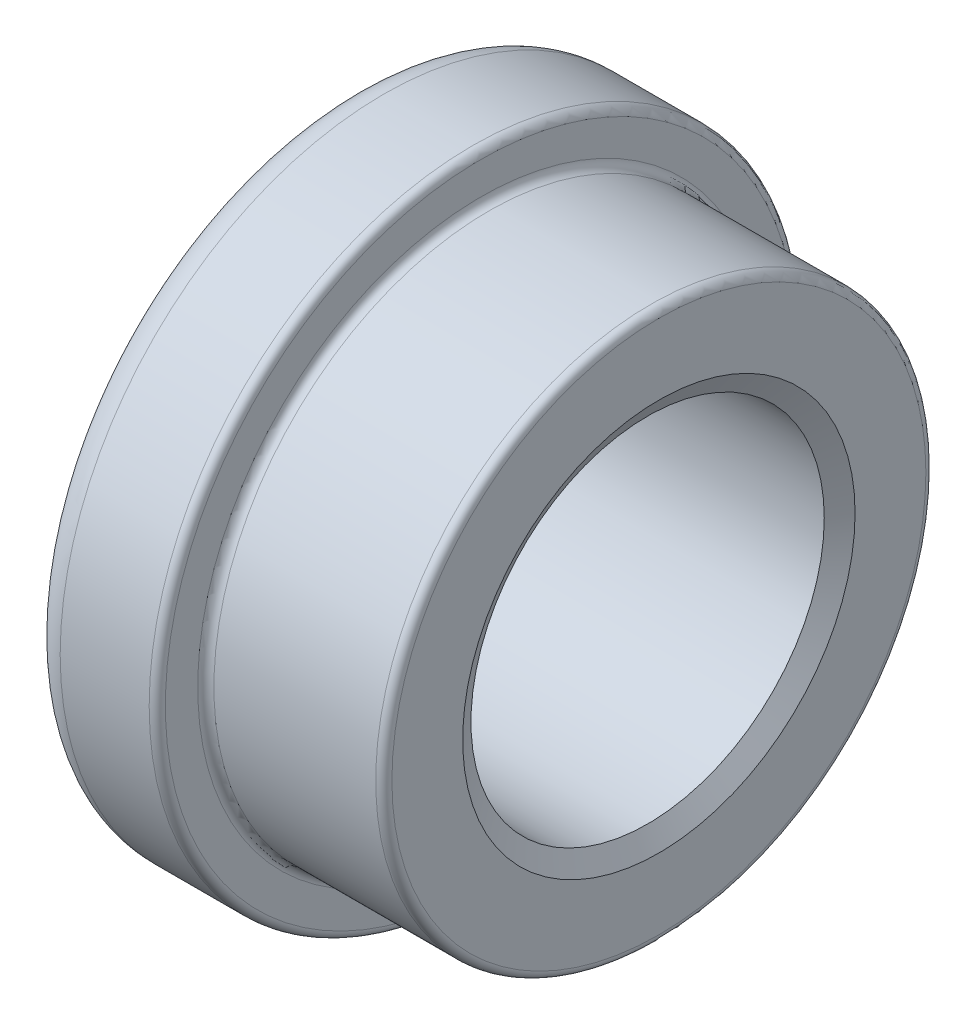
ISO-10303-21;
HEADER;
FILE_DESCRIPTION(('STEP AP214'),'2;1');
FILE_NAME('part.step','',(''),(''),'','','');
FILE_SCHEMA(('AUTOMOTIVE_DESIGN { 1 0 10303 214 1 1 1 1 }'));
ENDSEC;
DATA;
#1=APPLICATION_CONTEXT('core data for automotive mechanical design processes');
#2=APPLICATION_PROTOCOL_DEFINITION('international standard','automotive_design',2000,#1);
#3=PRODUCT_CONTEXT('',#1,'mechanical');
#4=PRODUCT('Part','Part','',(#3));
#5=PRODUCT_RELATED_PRODUCT_CATEGORY('part','',(#4));
#6=PRODUCT_DEFINITION_FORMATION('','',#4);
#7=PRODUCT_DEFINITION_CONTEXT('part definition',#1,'design');
#8=PRODUCT_DEFINITION('design','',#6,#7);
#9=PRODUCT_DEFINITION_SHAPE('','',#8);
#10=(LENGTH_UNIT() NAMED_UNIT(*) SI_UNIT(.MILLI.,.METRE.));
#11=(NAMED_UNIT(*) PLANE_ANGLE_UNIT() SI_UNIT($,.RADIAN.));
#12=(NAMED_UNIT(*) SI_UNIT($,.STERADIAN.) SOLID_ANGLE_UNIT());
#13=UNCERTAINTY_MEASURE_WITH_UNIT(LENGTH_MEASURE(1.E-05),#10,'distance_accuracy_value','');
#14=(GEOMETRIC_REPRESENTATION_CONTEXT(3) GLOBAL_UNCERTAINTY_ASSIGNED_CONTEXT((#13)) GLOBAL_UNIT_ASSIGNED_CONTEXT((#10,
#11,#12)) REPRESENTATION_CONTEXT('',''));
#15=CARTESIAN_POINT('',(0.,0.,0.));
#16=DIRECTION('',(0.,0.,1.));
#17=DIRECTION('',(1.,0.,0.));
#18=AXIS2_PLACEMENT_3D('',#15,#16,#17);
#19=CARTESIAN_POINT('',(-16.9999999999999,4.413136522885E-12,2.42861286636753E-13));
#20=DIRECTION('',(1.,0.,0.));
#21=DIRECTION('',(0.,0.,-1.00000000000001));
#22=AXIS2_PLACEMENT_3D('',#19,#20,#21);
#23=TOROIDAL_SURFACE('',#22,18.,2.);
#24=CARTESIAN_POINT('',(-18.9999999999998,4.413136522885E-12,2.70616862252382E-13));
#25=DIRECTION('',(1.,0.,0.));
#26=DIRECTION('',(0.,0.,-1.00000000000001));
#27=AXIS2_PLACEMENT_3D('',#24,#25,#26);
#28=CIRCLE('',#27,18.);
#29=CARTESIAN_POINT('',(-18.9999999999999,4.42737513317581E-12,-17.9999999999999));
#30=VERTEX_POINT('',#29);
#31=EDGE_CURVE('E12',#30,#30,#28,.T.);
#32=ORIENTED_EDGE('',*,*,#31,.T.);
#33=EDGE_LOOP('',(#32));
#34=FACE_BOUND('',#33,.T.);
#35=CARTESIAN_POINT('',(-16.9999999999999,4.413136522885E-12,2.42861286636753E-13));
#36=DIRECTION('',(1.,0.,0.));
#37=DIRECTION('',(0.,0.,-1.00000000000001));
#38=AXIS2_PLACEMENT_3D('',#35,#36,#37);
#39=CIRCLE('',#38,20.);
#40=CARTESIAN_POINT('',(-17.,4.4289572009859E-12,-19.9999999999999));
#41=VERTEX_POINT('',#40);
#42=EDGE_CURVE('E100',#41,#41,#39,.T.);
#43=ORIENTED_EDGE('',*,*,#42,.F.);
#44=EDGE_LOOP('',(#43));
#45=FACE_BOUND('',#44,.T.);
#46=ADVANCED_FACE('F48',(#34,#45),#23,.T.);
#47=CARTESIAN_POINT('',(-19.0000000000005,18.0000000000047,3.20923843055709E-13));
#48=DIRECTION('',(-1.,0.,0.));
#49=DIRECTION('',(0.,0.,1.00000000000001));
#50=AXIS2_PLACEMENT_3D('',#47,#48,#49);
#51=PLANE('',#50);
#52=CARTESIAN_POINT('',(-18.9999999999998,4.413136522885E-12,2.70616862252382E-13));
#53=DIRECTION('',(1.,0.,0.));
#54=DIRECTION('',(0.,0.,-1.00000000000001));
#55=AXIS2_PLACEMENT_3D('',#52,#53,#54);
#56=CIRCLE('',#55,12.125);
#57=CARTESIAN_POINT('',(-18.9999999999998,4.42272780898367E-12,-12.1249999999998));
#58=VERTEX_POINT('',#57);
#59=EDGE_CURVE('E55',#58,#58,#56,.T.);
#60=ORIENTED_EDGE('',*,*,#59,.T.);
#61=EDGE_LOOP('',(#60));
#62=FACE_BOUND('',#61,.T.);
#63=ORIENTED_EDGE('',*,*,#31,.F.);
#64=EDGE_LOOP('',(#63));
#65=FACE_BOUND('',#64,.T.);
#66=ADVANCED_FACE('F108',(#62,#65),#51,.T.);
#67=CARTESIAN_POINT('',(-18.9999999999998,4.413136522885E-12,2.70616862252382E-13));
#68=DIRECTION('',(-1.,0.,0.));
#69=DIRECTION('',(0.,0.,1.00000000000001));
#70=AXIS2_PLACEMENT_3D('',#67,#68,#69);
#71=CONICAL_SURFACE('',#70,12.125,1.0471975511966);
#72=CARTESIAN_POINT('',(-18.3028495499534,4.413136522885E-12,0.));
#73=DIRECTION('',(1.,0.,0.));
#74=DIRECTION('',(0.,0.,-1.00000000000001));
#75=AXIS2_PLACEMENT_3D('',#72,#73,#74);
#76=CIRCLE('',#75,10.9175);
#77=CARTESIAN_POINT('',(-18.3028495499535,4.42177263554333E-12,-10.9175000000001));
#78=VERTEX_POINT('',#77);
#79=EDGE_CURVE('E61',#78,#78,#76,.T.);
#80=ORIENTED_EDGE('',*,*,#79,.T.);
#81=EDGE_LOOP('',(#80));
#82=FACE_BOUND('',#81,.T.);
#83=ORIENTED_EDGE('',*,*,#59,.F.);
#84=EDGE_LOOP('',(#83));
#85=FACE_BOUND('',#84,.T.);
#86=ADVANCED_FACE('F112',(#82,#85),#71,.F.);
#87=CARTESIAN_POINT('',(0.,0.,0.));
#88=DIRECTION('',(1.,0.,0.));
#89=DIRECTION('',(0.,0.,-1.00000000000001));
#90=AXIS2_PLACEMENT_3D('',#87,#88,#89);
#91=CYLINDRICAL_SURFACE('',#90,10.9175);
#92=CARTESIAN_POINT('',(-0.697150450046438,0.,1.94289029309402E-13));
#93=DIRECTION('',(1.,0.,0.));
#94=DIRECTION('',(0.,0.,-1.00000000000001));
#95=AXIS2_PLACEMENT_3D('',#92,#93,#94);
#96=CIRCLE('',#95,10.9175);
#97=CARTESIAN_POINT('',(-0.697150450046514,0.,-10.9174999999999));
#98=VERTEX_POINT('',#97);
#99=EDGE_CURVE('E66',#98,#98,#96,.T.);
#100=ORIENTED_EDGE('',*,*,#99,.T.);
#101=EDGE_LOOP('',(#100));
#102=FACE_BOUND('',#101,.T.);
#103=ORIENTED_EDGE('',*,*,#79,.F.);
#104=EDGE_LOOP('',(#103));
#105=FACE_BOUND('',#104,.T.);
#106=ADVANCED_FACE('F116',(#102,#105),#91,.F.);
#107=CARTESIAN_POINT('',(-0.697150450046438,0.,1.94289029309402E-13));
#108=DIRECTION('',(1.,0.,0.));
#109=DIRECTION('',(0.,0.,-1.00000000000001));
#110=AXIS2_PLACEMENT_3D('',#107,#108,#109);
#111=CONICAL_SURFACE('',#110,10.9175,1.0471975511966);
#112=CARTESIAN_POINT('',(0.,0.,0.));
#113=DIRECTION('',(1.,0.,0.));
#114=DIRECTION('',(0.,0.,-1.00000000000001));
#115=AXIS2_PLACEMENT_3D('',#112,#113,#114);
#116=CIRCLE('',#115,12.125);
#117=CARTESIAN_POINT('',(0.,0.,-12.1250000000001));
#118=VERTEX_POINT('',#117);
#119=EDGE_CURVE('E72',#118,#118,#116,.T.);
#120=ORIENTED_EDGE('',*,*,#119,.T.);
#121=EDGE_LOOP('',(#120));
#122=FACE_BOUND('',#121,.T.);
#123=ORIENTED_EDGE('',*,*,#99,.F.);
#124=EDGE_LOOP('',(#123));
#125=FACE_BOUND('',#124,.T.);
#126=ADVANCED_FACE('F123',(#122,#125),#111,.F.);
#127=CARTESIAN_POINT('',(0.,12.1250000000002,0.));
#128=DIRECTION('',(1.,0.,0.));
#129=DIRECTION('',(0.,0.,-1.00000000000001));
#130=AXIS2_PLACEMENT_3D('',#127,#128,#129);
#131=PLANE('',#130);
#132=CARTESIAN_POINT('',(0.,0.,0.));
#133=DIRECTION('',(1.,0.,0.));
#134=DIRECTION('',(0.,0.,-1.00000000000001));
#135=AXIS2_PLACEMENT_3D('',#132,#133,#134);
#136=CIRCLE('',#135,16.5);
#137=CARTESIAN_POINT('',(-1.14163483621749E-13,0.,-16.5000000000001));
#138=VERTEX_POINT('',#137);
#139=EDGE_CURVE('E76',#138,#138,#136,.T.);
#140=ORIENTED_EDGE('',*,*,#139,.T.);
#141=EDGE_LOOP('',(#140));
#142=FACE_BOUND('',#141,.T.);
#143=ORIENTED_EDGE('',*,*,#119,.F.);
#144=EDGE_LOOP('',(#143));
#145=FACE_BOUND('',#144,.T.);
#146=ADVANCED_FACE('F127',(#142,#145),#131,.T.);
#147=CARTESIAN_POINT('',(-0.5,0.,0.));
#148=DIRECTION('',(1.,0.,0.));
#149=DIRECTION('',(0.,0.,-1.00000000000001));
#150=AXIS2_PLACEMENT_3D('',#147,#148,#149);
#151=TOROIDAL_SURFACE('',#150,16.5,0.5);
#152=CARTESIAN_POINT('',(-0.5,0.,0.));
#153=DIRECTION('',(1.,0.,0.));
#154=DIRECTION('',(0.,0.,-1.00000000000001));
#155=AXIS2_PLACEMENT_3D('',#152,#153,#154);
#156=CIRCLE('',#155,17.);
#157=CARTESIAN_POINT('',(-0.500000000000118,0.,-17.0000000000001));
#158=VERTEX_POINT('',#157);
#159=EDGE_CURVE('E80',#158,#158,#156,.T.);
#160=ORIENTED_EDGE('',*,*,#159,.T.);
#161=EDGE_LOOP('',(#160));
#162=FACE_BOUND('',#161,.T.);
#163=ORIENTED_EDGE('',*,*,#139,.F.);
#164=EDGE_LOOP('',(#163));
#165=FACE_BOUND('',#164,.T.);
#166=ADVANCED_FACE('F131',(#162,#165),#151,.T.);
#167=CARTESIAN_POINT('',(0.,0.,0.));
#168=DIRECTION('',(1.,0.,0.));
#169=DIRECTION('',(0.,0.,-1.00000000000001));
#170=AXIS2_PLACEMENT_3D('',#167,#168,#169);
#171=CYLINDRICAL_SURFACE('',#170,17.);
#172=CARTESIAN_POINT('',(-10.4999999999999,4.85722573273506E-12,1.6826817716975E-13));
#173=DIRECTION('',(1.,0.,0.));
#174=DIRECTION('',(0.,0.,-1.00000000000001));
#175=AXIS2_PLACEMENT_3D('',#172,#173,#174);
#176=CIRCLE('',#175,17.);
#177=CARTESIAN_POINT('',(-10.5,4.87067330912083E-12,-17.));
#178=VERTEX_POINT('',#177);
#179=EDGE_CURVE('E84',#178,#178,#176,.T.);
#180=ORIENTED_EDGE('',*,*,#179,.T.);
#181=EDGE_LOOP('',(#180));
#182=FACE_BOUND('',#181,.T.);
#183=ORIENTED_EDGE('',*,*,#159,.F.);
#184=EDGE_LOOP('',(#183));
#185=FACE_BOUND('',#184,.T.);
#186=ADVANCED_FACE('F135',(#182,#185),#171,.T.);
#187=CARTESIAN_POINT('',(-10.4999999999999,4.85722573273506E-12,1.6826817716975E-13));
#188=DIRECTION('',(1.,0.,0.));
#189=DIRECTION('',(0.,0.,-1.00000000000001));
#190=AXIS2_PLACEMENT_3D('',#187,#188,#189);
#191=TOROIDAL_SURFACE('',#190,17.5,0.5);
#192=CARTESIAN_POINT('',(-10.9999999999999,4.85722573273506E-12,1.40512601554121E-13));
#193=DIRECTION('',(1.,0.,0.));
#194=DIRECTION('',(0.,0.,-1.00000000000001));
#195=AXIS2_PLACEMENT_3D('',#192,#193,#194);
#196=CIRCLE('',#195,17.5);
#197=CARTESIAN_POINT('',(-11.,4.87106882607335E-12,-17.5));
#198=VERTEX_POINT('',#197);
#199=EDGE_CURVE('E88',#198,#198,#196,.T.);
#200=ORIENTED_EDGE('',*,*,#199,.T.);
#201=EDGE_LOOP('',(#200));
#202=FACE_BOUND('',#201,.T.);
#203=ORIENTED_EDGE('',*,*,#179,.F.);
#204=EDGE_LOOP('',(#203));
#205=FACE_BOUND('',#204,.T.);
#206=ADVANCED_FACE('F139',(#202,#205),#191,.F.);
#207=CARTESIAN_POINT('',(-11.0000000000001,17.500000000005,6.5746019739521E-13));
#208=DIRECTION('',(1.,0.,0.));
#209=DIRECTION('',(0.,0.,-1.00000000000001));
#210=AXIS2_PLACEMENT_3D('',#207,#208,#209);
#211=PLANE('',#210);
#212=CARTESIAN_POINT('',(-10.9999999999999,4.85722573273506E-12,1.40512601554121E-13));
#213=DIRECTION('',(1.,0.,0.));
#214=DIRECTION('',(0.,0.,-1.00000000000001));
#215=AXIS2_PLACEMENT_3D('',#212,#213,#214);
#216=CIRCLE('',#215,19.5);
#217=CARTESIAN_POINT('',(-11.,4.87265089388344E-12,-19.5));
#218=VERTEX_POINT('',#217);
#219=EDGE_CURVE('E92',#218,#218,#216,.T.);
#220=ORIENTED_EDGE('',*,*,#219,.T.);
#221=EDGE_LOOP('',(#220));
#222=FACE_BOUND('',#221,.T.);
#223=ORIENTED_EDGE('',*,*,#199,.F.);
#224=EDGE_LOOP('',(#223));
#225=FACE_BOUND('',#224,.T.);
#226=ADVANCED_FACE('F143',(#222,#225),#211,.T.);
#227=CARTESIAN_POINT('',(-11.4999999999999,5.30131494258512E-12,-1.11022302462516E-13));
#228=DIRECTION('',(1.,0.,0.));
#229=DIRECTION('',(0.,0.,-1.00000000000001));
#230=AXIS2_PLACEMENT_3D('',#227,#228,#229);
#231=TOROIDAL_SURFACE('',#230,19.5,0.499999999999999);
#232=CARTESIAN_POINT('',(-11.4999999999999,5.30131494258512E-12,-1.11022302462516E-13));
#233=DIRECTION('',(1.,0.,0.));
#234=DIRECTION('',(0.,0.,-1.00000000000001));
#235=AXIS2_PLACEMENT_3D('',#232,#233,#234);
#236=CIRCLE('',#235,20.);
#237=CARTESIAN_POINT('',(-11.5000000000001,5.31713562068603E-12,-20.0000000000003));
#238=VERTEX_POINT('',#237);
#239=EDGE_CURVE('E96',#238,#238,#236,.T.);
#240=ORIENTED_EDGE('',*,*,#239,.T.);
#241=EDGE_LOOP('',(#240));
#242=FACE_BOUND('',#241,.T.);
#243=ORIENTED_EDGE('',*,*,#219,.F.);
#244=EDGE_LOOP('',(#243));
#245=FACE_BOUND('',#244,.T.);
#246=ADVANCED_FACE('F147',(#242,#245),#231,.T.);
#247=CARTESIAN_POINT('',(0.,0.,0.));
#248=DIRECTION('',(1.,0.,0.));
#249=DIRECTION('',(0.,0.,-1.00000000000001));
#250=AXIS2_PLACEMENT_3D('',#247,#248,#249);
#251=CYLINDRICAL_SURFACE('',#250,20.);
#252=ORIENTED_EDGE('',*,*,#42,.T.);
#253=EDGE_LOOP('',(#252));
#254=FACE_BOUND('',#253,.T.);
#255=ORIENTED_EDGE('',*,*,#239,.F.);
#256=EDGE_LOOP('',(#255));
#257=FACE_BOUND('',#256,.T.);
#258=ADVANCED_FACE('F104',(#254,#257),#251,.T.);
#259=CLOSED_SHELL('',(#46,#66,#86,#106,#126,#146,#166,#186,#206,#226,#246,#258));
#260=MANIFOLD_SOLID_BREP('B2',#259);
#261=ADVANCED_BREP_SHAPE_REPRESENTATION('',(#18,#260),#14);
#262=SHAPE_DEFINITION_REPRESENTATION(#9,#261);
ENDSEC;
END-ISO-10303-21;
